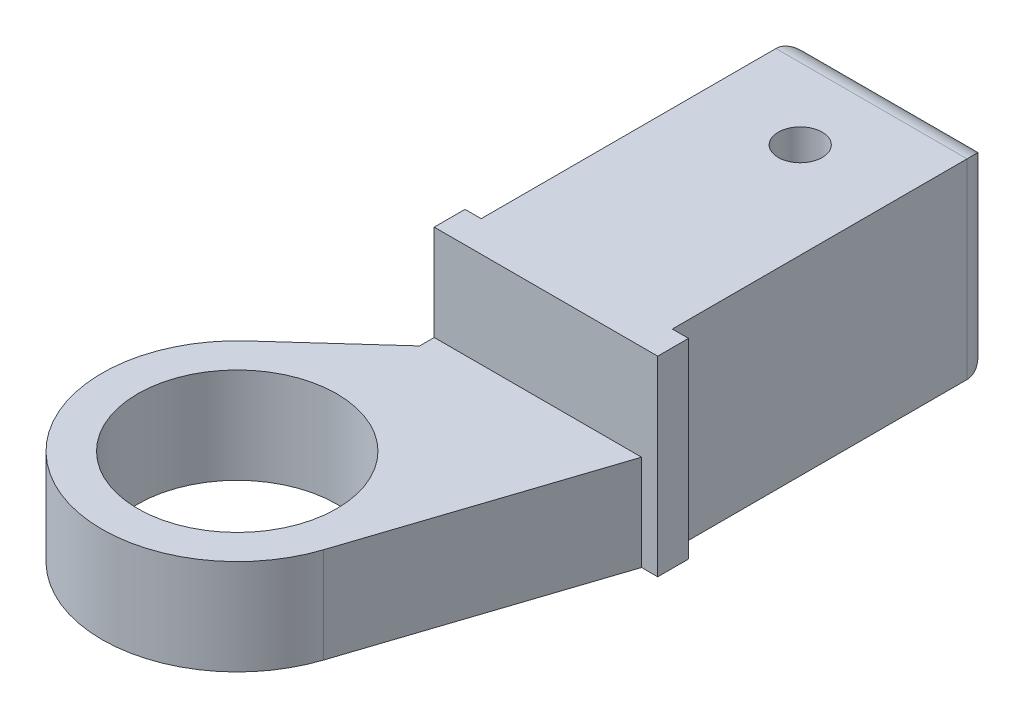
ISO-10303-21;
HEADER;
FILE_DESCRIPTION(('STEP AP214'),'2;1');
FILE_NAME('part.step','',(''),(''),'','','');
FILE_SCHEMA(('AUTOMOTIVE_DESIGN { 1 0 10303 214 1 1 1 1 }'));
ENDSEC;
DATA;
#1=APPLICATION_CONTEXT('core data for automotive mechanical design processes');
#2=APPLICATION_PROTOCOL_DEFINITION('international standard','automotive_design',2000,#1);
#3=PRODUCT_CONTEXT('',#1,'mechanical');
#4=PRODUCT('Part','Part','',(#3));
#5=PRODUCT_RELATED_PRODUCT_CATEGORY('part','',(#4));
#6=PRODUCT_DEFINITION_FORMATION('','',#4);
#7=PRODUCT_DEFINITION_CONTEXT('part definition',#1,'design');
#8=PRODUCT_DEFINITION('design','',#6,#7);
#9=PRODUCT_DEFINITION_SHAPE('','',#8);
#10=(LENGTH_UNIT() NAMED_UNIT(*) SI_UNIT(.MILLI.,.METRE.));
#11=(NAMED_UNIT(*) PLANE_ANGLE_UNIT() SI_UNIT($,.RADIAN.));
#12=(NAMED_UNIT(*) SI_UNIT($,.STERADIAN.) SOLID_ANGLE_UNIT());
#13=UNCERTAINTY_MEASURE_WITH_UNIT(LENGTH_MEASURE(1.E-05),#10,'distance_accuracy_value','');
#14=(GEOMETRIC_REPRESENTATION_CONTEXT(3) GLOBAL_UNCERTAINTY_ASSIGNED_CONTEXT((#13)) GLOBAL_UNIT_ASSIGNED_CONTEXT((#10,
#11,#12)) REPRESENTATION_CONTEXT('',''));
#15=CARTESIAN_POINT('',(0.,0.,0.));
#16=DIRECTION('',(0.,0.,1.));
#17=DIRECTION('',(1.,0.,0.));
#18=AXIS2_PLACEMENT_3D('',#15,#16,#17);
#19=CARTESIAN_POINT('',(23.8125,0.25,40.));
#20=DIRECTION('',(0.,0.,1.));
#21=DIRECTION('',(1.,0.,0.));
#22=AXIS2_PLACEMENT_3D('',#19,#20,#21);
#23=PLANE('',#22);
#24=DIRECTION('',(0.,1.,0.));
#25=VECTOR('',#24,1.);
#26=CARTESIAN_POINT('',(-1.5875,0.25,40.));
#27=LINE('',#26,#25);
#28=CARTESIAN_POINT('',(-1.5875,0.25,40.));
#29=VERTEX_POINT('',#28);
#30=CARTESIAN_POINT('',(-1.5875,21.975,40.));
#31=VERTEX_POINT('',#30);
#32=EDGE_CURVE('E189',#29,#31,#27,.T.);
#33=ORIENTED_EDGE('',*,*,#32,.F.);
#34=DIRECTION('',(1.,0.,0.));
#35=VECTOR('',#34,1.);
#36=CARTESIAN_POINT('',(-1.5875,0.25,40.));
#37=LINE('',#36,#35);
#38=CARTESIAN_POINT('',(23.8125,0.25,40.));
#39=VERTEX_POINT('',#38);
#40=EDGE_CURVE('E212',#29,#39,#37,.T.);
#41=ORIENTED_EDGE('',*,*,#40,.T.);
#42=DIRECTION('',(0.,1.,0.));
#43=VECTOR('',#42,1.);
#44=CARTESIAN_POINT('',(23.8125,0.25,40.));
#45=LINE('',#44,#43);
#46=CARTESIAN_POINT('',(23.8125,21.975,40.));
#47=VERTEX_POINT('',#46);
#48=EDGE_CURVE('E192',#39,#47,#45,.T.);
#49=ORIENTED_EDGE('',*,*,#48,.T.);
#50=DIRECTION('',(-1.,0.,0.));
#51=VECTOR('',#50,1.);
#52=CARTESIAN_POINT('',(16.54375,21.975,40.));
#53=LINE('',#52,#51);
#54=EDGE_CURVE('E190',#47,#31,#53,.T.);
#55=ORIENTED_EDGE('',*,*,#54,.T.);
#56=EDGE_LOOP('',(#33,#41,#49,#55));
#57=FACE_BOUND('',#56,.T.);
#58=ADVANCED_FACE('F48',(#57),#23,.T.);
#59=CARTESIAN_POINT('',(18.975,5.68125,3.));
#60=DIRECTION('',(0.,1.,0.));
#61=DIRECTION('',(0.707106781186548,0.,-0.707106781186547));
#62=AXIS2_PLACEMENT_3D('',#59,#60,#61);
#63=CYLINDRICAL_SURFACE('',#62,3.);
#64=DIRECTION('',(0.,-1.,0.));
#65=VECTOR('',#64,1.);
#66=CARTESIAN_POINT('',(21.975,5.68125,3.));
#67=LINE('',#66,#65);
#68=CARTESIAN_POINT('',(21.975,21.975,3.));
#69=VERTEX_POINT('',#68);
#70=CARTESIAN_POINT('',(21.975,0.25,3.));
#71=VERTEX_POINT('',#70);
#72=EDGE_CURVE('E155',#69,#71,#67,.T.);
#73=ORIENTED_EDGE('',*,*,#72,.T.);
#74=CARTESIAN_POINT('',(18.975,3.25,3.));
#75=DIRECTION('',(-0.707106781186547,-0.707106781186548,0.));
#76=DIRECTION('',(-0.707106781186548,0.707106781186547,0.));
#77=AXIS2_PLACEMENT_3D('',#74,#75,#76);
#78=ELLIPSE('',#77,4.24264068711929,3.);
#79=CARTESIAN_POINT('',(18.975,3.25,0.));
#80=VERTEX_POINT('',#79);
#81=EDGE_CURVE('E131',#80,#71,#78,.T.);
#82=ORIENTED_EDGE('',*,*,#81,.F.);
#83=DIRECTION('',(0.,1.,0.));
#84=VECTOR('',#83,1.);
#85=CARTESIAN_POINT('',(18.975,5.68125,0.));
#86=LINE('',#85,#84);
#87=CARTESIAN_POINT('',(18.975,18.975,0.));
#88=VERTEX_POINT('',#87);
#89=EDGE_CURVE('E211',#80,#88,#86,.T.);
#90=ORIENTED_EDGE('',*,*,#89,.T.);
#91=CARTESIAN_POINT('',(18.975,18.975,3.));
#92=DIRECTION('',(0.707106781186548,-0.707106781186548,0.));
#93=DIRECTION('',(-0.707106781186548,-0.707106781186548,0.));
#94=AXIS2_PLACEMENT_3D('',#91,#92,#93);
#95=ELLIPSE('',#94,4.24264068711929,3.);
#96=EDGE_CURVE('E158',#88,#69,#95,.T.);
#97=ORIENTED_EDGE('',*,*,#96,.T.);
#98=EDGE_LOOP('',(#73,#82,#90,#97));
#99=FACE_BOUND('',#98,.T.);
#100=ADVANCED_FACE('F156',(#99),#63,.T.);
#101=CARTESIAN_POINT('',(11.1125,11.1125,0.));
#102=DIRECTION('',(0.,0.,1.));
#103=DIRECTION('',(1.,0.,0.));
#104=AXIS2_PLACEMENT_3D('',#101,#102,#103);
#105=PLANE('',#104);
#106=DIRECTION('',(1.,0.,0.));
#107=VECTOR('',#106,1.);
#108=CARTESIAN_POINT('',(5.68125,3.25,0.));
#109=LINE('',#108,#107);
#110=CARTESIAN_POINT('',(3.25,3.25,0.));
#111=VERTEX_POINT('',#110);
#112=EDGE_CURVE('E138',#111,#80,#109,.T.);
#113=ORIENTED_EDGE('',*,*,#112,.F.);
#114=DIRECTION('',(0.,-1.,0.));
#115=VECTOR('',#114,1.);
#116=CARTESIAN_POINT('',(3.25,16.54375,0.));
#117=LINE('',#116,#115);
#118=CARTESIAN_POINT('',(3.25,18.975,0.));
#119=VERTEX_POINT('',#118);
#120=EDGE_CURVE('E142',#119,#111,#117,.T.);
#121=ORIENTED_EDGE('',*,*,#120,.F.);
#122=DIRECTION('',(-1.,0.,0.));
#123=VECTOR('',#122,1.);
#124=CARTESIAN_POINT('',(16.54375,18.975,0.));
#125=LINE('',#124,#123);
#126=EDGE_CURVE('E182',#88,#119,#125,.T.);
#127=ORIENTED_EDGE('',*,*,#126,.F.);
#128=ORIENTED_EDGE('',*,*,#89,.F.);
#129=EDGE_LOOP('',(#113,#121,#127,#128));
#130=FACE_BOUND('',#129,.T.);
#131=ADVANCED_FACE('F227',(#130),#105,.F.);
#132=CARTESIAN_POINT('',(3.25,16.54375,3.));
#133=DIRECTION('',(0.,-1.,0.));
#134=DIRECTION('',(-0.707106781186548,0.,-0.707106781186548));
#135=AXIS2_PLACEMENT_3D('',#132,#133,#134);
#136=CYLINDRICAL_SURFACE('',#135,3.);
#137=ORIENTED_EDGE('',*,*,#120,.T.);
#138=CARTESIAN_POINT('',(3.25,3.25,3.));
#139=DIRECTION('',(0.707106781186548,-0.707106781186547,0.));
#140=DIRECTION('',(-0.707106781186547,-0.707106781186548,0.));
#141=AXIS2_PLACEMENT_3D('',#138,#139,#140);
#142=ELLIPSE('',#141,4.24264068711929,3.);
#143=CARTESIAN_POINT('',(0.25,0.25,3.));
#144=VERTEX_POINT('',#143);
#145=EDGE_CURVE('E171',#144,#111,#142,.T.);
#146=ORIENTED_EDGE('',*,*,#145,.F.);
#147=DIRECTION('',(0.,1.,0.));
#148=VECTOR('',#147,1.);
#149=CARTESIAN_POINT('',(0.25,16.54375,3.));
#150=LINE('',#149,#148);
#151=CARTESIAN_POINT('',(0.25,21.975,3.));
#152=VERTEX_POINT('',#151);
#153=EDGE_CURVE('E180',#144,#152,#150,.T.);
#154=ORIENTED_EDGE('',*,*,#153,.T.);
#155=CARTESIAN_POINT('',(3.25,18.975,3.));
#156=DIRECTION('',(0.707106781186548,0.707106781186547,0.));
#157=DIRECTION('',(0.707106781186547,-0.707106781186548,0.));
#158=AXIS2_PLACEMENT_3D('',#155,#156,#157);
#159=ELLIPSE('',#158,4.24264068711928,3.);
#160=EDGE_CURVE('E196',#119,#152,#159,.T.);
#161=ORIENTED_EDGE('',*,*,#160,.F.);
#162=EDGE_LOOP('',(#137,#146,#154,#161));
#163=FACE_BOUND('',#162,.T.);
#164=ADVANCED_FACE('F223',(#163),#136,.T.);
#165=CARTESIAN_POINT('',(16.54375,18.975,3.));
#166=DIRECTION('',(-1.,0.,0.));
#167=DIRECTION('',(0.,0.707106781186548,-0.707106781186547));
#168=AXIS2_PLACEMENT_3D('',#165,#166,#167);
#169=CYLINDRICAL_SURFACE('',#168,3.);
#170=DIRECTION('',(1.,0.,0.));
#171=VECTOR('',#170,1.);
#172=CARTESIAN_POINT('',(16.54375,21.975,3.));
#173=LINE('',#172,#171);
#174=EDGE_CURVE('E184',#152,#69,#173,.T.);
#175=ORIENTED_EDGE('',*,*,#174,.T.);
#176=ORIENTED_EDGE('',*,*,#96,.F.);
#177=ORIENTED_EDGE('',*,*,#126,.T.);
#178=ORIENTED_EDGE('',*,*,#160,.T.);
#179=EDGE_LOOP('',(#175,#176,#177,#178));
#180=FACE_BOUND('',#179,.T.);
#181=ADVANCED_FACE('F256',(#180),#169,.T.);
#182=CARTESIAN_POINT('',(21.975,21.975,0.));
#183=DIRECTION('',(0.,1.,0.));
#184=DIRECTION('',(1.,0.,0.));
#185=AXIS2_PLACEMENT_3D('',#182,#183,#184);
#186=PLANE('',#185);
#187=CARTESIAN_POINT('',(11.1125,21.975,11.1));
#188=DIRECTION('',(0.,-1.,0.));
#189=DIRECTION('',(1.,0.,0.));
#190=AXIS2_PLACEMENT_3D('',#187,#188,#189);
#191=CIRCLE('',#190,2.5);
#192=CARTESIAN_POINT('',(8.6125,21.975,11.1));
#193=VERTEX_POINT('',#192);
#194=EDGE_CURVE('E12',#193,#193,#191,.T.);
#195=ORIENTED_EDGE('',*,*,#194,.T.);
#196=EDGE_LOOP('',(#195));
#197=FACE_BOUND('',#196,.T.);
#198=ORIENTED_EDGE('',*,*,#174,.F.);
#199=DIRECTION('',(0.,0.,1.));
#200=VECTOR('',#199,1.);
#201=CARTESIAN_POINT('',(0.25,21.975,0.));
#202=LINE('',#201,#200);
#203=CARTESIAN_POINT('',(0.25,21.975,36.5));
#204=VERTEX_POINT('',#203);
#205=EDGE_CURVE('E185',#152,#204,#202,.T.);
#206=ORIENTED_EDGE('',*,*,#205,.T.);
#207=DIRECTION('',(1.,0.,0.));
#208=VECTOR('',#207,1.);
#209=CARTESIAN_POINT('',(5.68125,21.975,36.5));
#210=LINE('',#209,#208);
#211=CARTESIAN_POINT('',(-1.5875,21.975,36.5));
#212=VERTEX_POINT('',#211);
#213=EDGE_CURVE('E178',#212,#204,#210,.T.);
#214=ORIENTED_EDGE('',*,*,#213,.F.);
#215=DIRECTION('',(0.,0.,-1.));
#216=VECTOR('',#215,1.);
#217=CARTESIAN_POINT('',(-1.5875,21.975,37.375));
#218=LINE('',#217,#216);
#219=EDGE_CURVE('E177',#31,#212,#218,.T.);
#220=ORIENTED_EDGE('',*,*,#219,.F.);
#221=ORIENTED_EDGE('',*,*,#54,.F.);
#222=DIRECTION('',(0.,0.,1.));
#223=VECTOR('',#222,1.);
#224=CARTESIAN_POINT('',(23.8125,21.975,39.125));
#225=LINE('',#224,#223);
#226=CARTESIAN_POINT('',(23.8125,21.975,36.5));
#227=VERTEX_POINT('',#226);
#228=EDGE_CURVE('E173',#227,#47,#225,.T.);
#229=ORIENTED_EDGE('',*,*,#228,.F.);
#230=DIRECTION('',(1.,0.,0.));
#231=VECTOR('',#230,1.);
#232=CARTESIAN_POINT('',(17.4625,21.975,36.5));
#233=LINE('',#232,#231);
#234=CARTESIAN_POINT('',(21.975,21.975,36.5));
#235=VERTEX_POINT('',#234);
#236=EDGE_CURVE('E193',#235,#227,#233,.T.);
#237=ORIENTED_EDGE('',*,*,#236,.F.);
#238=DIRECTION('',(0.,0.,1.));
#239=VECTOR('',#238,1.);
#240=CARTESIAN_POINT('',(21.975,21.975,0.));
#241=LINE('',#240,#239);
#242=EDGE_CURVE('E162',#69,#235,#241,.T.);
#243=ORIENTED_EDGE('',*,*,#242,.F.);
#244=EDGE_LOOP('',(#198,#206,#214,#220,#221,#229,#237,#243));
#245=FACE_BOUND('',#244,.T.);
#246=ADVANCED_FACE('F216',(#197,#245),#186,.T.);
#247=CARTESIAN_POINT('',(23.8125,0.25,40.));
#248=DIRECTION('',(1.,0.,0.));
#249=DIRECTION('',(0.,1.,0.));
#250=AXIS2_PLACEMENT_3D('',#247,#248,#249);
#251=PLANE('',#250);
#252=DIRECTION('',(0.,0.,-1.));
#253=VECTOR('',#252,1.);
#254=CARTESIAN_POINT('',(23.8125,0.25,40.));
#255=LINE('',#254,#253);
#256=CARTESIAN_POINT('',(23.8125,0.25,36.5));
#257=VERTEX_POINT('',#256);
#258=EDGE_CURVE('E213',#39,#257,#255,.T.);
#259=ORIENTED_EDGE('',*,*,#258,.T.);
#260=DIRECTION('',(0.,1.,0.));
#261=VECTOR('',#260,1.);
#262=CARTESIAN_POINT('',(23.8125,0.25,36.5));
#263=LINE('',#262,#261);
#264=EDGE_CURVE('E232',#257,#227,#263,.T.);
#265=ORIENTED_EDGE('',*,*,#264,.T.);
#266=ORIENTED_EDGE('',*,*,#228,.T.);
#267=ORIENTED_EDGE('',*,*,#48,.F.);
#268=EDGE_LOOP('',(#259,#265,#266,#267));
#269=FACE_BOUND('',#268,.T.);
#270=ADVANCED_FACE('F238',(#269),#251,.T.);
#271=CARTESIAN_POINT('',(23.8125,0.25,36.5));
#272=DIRECTION('',(0.,0.,-1.));
#273=DIRECTION('',(0.,-1.,0.));
#274=AXIS2_PLACEMENT_3D('',#271,#272,#273);
#275=PLANE('',#274);
#276=DIRECTION('',(-1.,0.,0.));
#277=VECTOR('',#276,1.);
#278=CARTESIAN_POINT('',(23.8125,0.25,36.5));
#279=LINE('',#278,#277);
#280=CARTESIAN_POINT('',(21.975,0.25,36.5));
#281=VERTEX_POINT('',#280);
#282=EDGE_CURVE('E124',#257,#281,#279,.T.);
#283=ORIENTED_EDGE('',*,*,#282,.T.);
#284=DIRECTION('',(0.,-1.,0.));
#285=VECTOR('',#284,1.);
#286=CARTESIAN_POINT('',(21.975,0.25,36.5));
#287=LINE('',#286,#285);
#288=EDGE_CURVE('E165',#235,#281,#287,.T.);
#289=ORIENTED_EDGE('',*,*,#288,.F.);
#290=ORIENTED_EDGE('',*,*,#236,.T.);
#291=ORIENTED_EDGE('',*,*,#264,.F.);
#292=EDGE_LOOP('',(#283,#289,#290,#291));
#293=FACE_BOUND('',#292,.T.);
#294=ADVANCED_FACE('F278',(#293),#275,.T.);
#295=CARTESIAN_POINT('',(21.975,0.25,0.));
#296=DIRECTION('',(1.,0.,0.));
#297=DIRECTION('',(0.,1.,0.));
#298=AXIS2_PLACEMENT_3D('',#295,#296,#297);
#299=PLANE('',#298);
#300=ORIENTED_EDGE('',*,*,#288,.T.);
#301=DIRECTION('',(0.,0.,1.));
#302=VECTOR('',#301,1.);
#303=CARTESIAN_POINT('',(21.975,0.25,0.));
#304=LINE('',#303,#302);
#305=EDGE_CURVE('E147',#71,#281,#304,.T.);
#306=ORIENTED_EDGE('',*,*,#305,.F.);
#307=ORIENTED_EDGE('',*,*,#72,.F.);
#308=ORIENTED_EDGE('',*,*,#242,.T.);
#309=EDGE_LOOP('',(#300,#306,#307,#308));
#310=FACE_BOUND('',#309,.T.);
#311=ADVANCED_FACE('F164',(#310),#299,.T.);
#312=CARTESIAN_POINT('',(5.68125,3.25,3.));
#313=DIRECTION('',(1.,0.,0.));
#314=DIRECTION('',(0.,-0.707106781186548,-0.707106781186548));
#315=AXIS2_PLACEMENT_3D('',#312,#313,#314);
#316=CYLINDRICAL_SURFACE('',#315,3.);
#317=DIRECTION('',(-1.,0.,0.));
#318=VECTOR('',#317,1.);
#319=CARTESIAN_POINT('',(5.68125,0.25,3.));
#320=LINE('',#319,#318);
#321=EDGE_CURVE('E135',#71,#144,#320,.T.);
#322=ORIENTED_EDGE('',*,*,#321,.T.);
#323=ORIENTED_EDGE('',*,*,#145,.T.);
#324=ORIENTED_EDGE('',*,*,#112,.T.);
#325=ORIENTED_EDGE('',*,*,#81,.T.);
#326=EDGE_LOOP('',(#322,#323,#324,#325));
#327=FACE_BOUND('',#326,.T.);
#328=ADVANCED_FACE('F133',(#327),#316,.T.);
#329=CARTESIAN_POINT('',(0.25,21.975,0.));
#330=DIRECTION('',(-1.,0.,0.));
#331=DIRECTION('',(0.,1.,0.));
#332=AXIS2_PLACEMENT_3D('',#329,#330,#331);
#333=PLANE('',#332);
#334=DIRECTION('',(0.,1.,0.));
#335=VECTOR('',#334,1.);
#336=CARTESIAN_POINT('',(0.25,11.1125,36.5));
#337=LINE('',#336,#335);
#338=CARTESIAN_POINT('',(0.25,0.25,36.5));
#339=VERTEX_POINT('',#338);
#340=EDGE_CURVE('E198',#339,#204,#337,.T.);
#341=ORIENTED_EDGE('',*,*,#340,.T.);
#342=ORIENTED_EDGE('',*,*,#205,.F.);
#343=ORIENTED_EDGE('',*,*,#153,.F.);
#344=DIRECTION('',(0.,0.,1.));
#345=VECTOR('',#344,1.);
#346=CARTESIAN_POINT('',(0.25,0.25,0.));
#347=LINE('',#346,#345);
#348=EDGE_CURVE('E151',#144,#339,#347,.T.);
#349=ORIENTED_EDGE('',*,*,#348,.T.);
#350=EDGE_LOOP('',(#341,#342,#343,#349));
#351=FACE_BOUND('',#350,.T.);
#352=ADVANCED_FACE('F219',(#351),#333,.T.);
#353=CARTESIAN_POINT('',(0.25,0.25,36.5));
#354=DIRECTION('',(0.,0.,-1.));
#355=DIRECTION('',(0.,-1.,0.));
#356=AXIS2_PLACEMENT_3D('',#353,#354,#355);
#357=PLANE('',#356);
#358=DIRECTION('',(-1.,0.,0.));
#359=VECTOR('',#358,1.);
#360=CARTESIAN_POINT('',(23.8125,0.25,36.5));
#361=LINE('',#360,#359);
#362=CARTESIAN_POINT('',(-1.5875,0.25,36.5));
#363=VERTEX_POINT('',#362);
#364=EDGE_CURVE('E247',#339,#363,#361,.T.);
#365=ORIENTED_EDGE('',*,*,#364,.T.);
#366=DIRECTION('',(0.,1.,0.));
#367=VECTOR('',#366,1.);
#368=CARTESIAN_POINT('',(-1.5875,0.25,36.5));
#369=LINE('',#368,#367);
#370=EDGE_CURVE('E174',#363,#212,#369,.T.);
#371=ORIENTED_EDGE('',*,*,#370,.T.);
#372=ORIENTED_EDGE('',*,*,#213,.T.);
#373=ORIENTED_EDGE('',*,*,#340,.F.);
#374=EDGE_LOOP('',(#365,#371,#372,#373));
#375=FACE_BOUND('',#374,.T.);
#376=ADVANCED_FACE('F281',(#375),#357,.T.);
#377=CARTESIAN_POINT('',(-1.5875,0.25,36.5));
#378=DIRECTION('',(-1.,0.,0.));
#379=DIRECTION('',(0.,0.,1.));
#380=AXIS2_PLACEMENT_3D('',#377,#378,#379);
#381=PLANE('',#380);
#382=DIRECTION('',(0.,0.,1.));
#383=VECTOR('',#382,1.);
#384=CARTESIAN_POINT('',(-1.5875,0.25,0.));
#385=LINE('',#384,#383);
#386=EDGE_CURVE('E52',#363,#29,#385,.T.);
#387=ORIENTED_EDGE('',*,*,#386,.T.);
#388=ORIENTED_EDGE('',*,*,#32,.T.);
#389=ORIENTED_EDGE('',*,*,#219,.T.);
#390=ORIENTED_EDGE('',*,*,#370,.F.);
#391=EDGE_LOOP('',(#387,#388,#389,#390));
#392=FACE_BOUND('',#391,.T.);
#393=ADVANCED_FACE('F245',(#392),#381,.T.);
#394=CARTESIAN_POINT('',(11.1125,21.975,11.1));
#395=DIRECTION('',(0.,-1.,0.));
#396=DIRECTION('',(1.,0.,0.));
#397=AXIS2_PLACEMENT_3D('',#394,#395,#396);
#398=CYLINDRICAL_SURFACE('',#397,2.5);
#399=ORIENTED_EDGE('',*,*,#194,.F.);
#400=DIRECTION('',(0.,-1.,0.));
#401=VECTOR('',#400,1.);
#402=CARTESIAN_POINT('',(8.6125,21.975,11.1));
#403=LINE('',#402,#401);
#404=CARTESIAN_POINT('',(8.6125,0.249999999999995,11.1));
#405=VERTEX_POINT('',#404);
#406=EDGE_CURVE('E58',#193,#405,#403,.T.);
#407=ORIENTED_EDGE('',*,*,#406,.T.);
#408=CARTESIAN_POINT('',(11.1125,0.249999999999995,11.1));
#409=DIRECTION('',(0.,1.,0.));
#410=DIRECTION('',(1.,0.,0.));
#411=AXIS2_PLACEMENT_3D('',#408,#409,#410);
#412=CIRCLE('',#411,2.5);
#413=EDGE_CURVE('E167',#405,#405,#412,.T.);
#414=ORIENTED_EDGE('',*,*,#413,.F.);
#415=ORIENTED_EDGE('',*,*,#406,.F.);
#416=EDGE_LOOP('',(#399,#407,#414,#415));
#417=FACE_BOUND('',#416,.T.);
#418=ADVANCED_FACE('F280',(#417),#398,.F.);
#419=CARTESIAN_POINT('',(0.25,0.25,0.));
#420=DIRECTION('',(0.,-1.,0.));
#421=DIRECTION('',(0.,0.,-1.));
#422=AXIS2_PLACEMENT_3D('',#419,#420,#421);
#423=PLANE('',#422);
#424=ORIENTED_EDGE('',*,*,#413,.T.);
#425=EDGE_LOOP('',(#424));
#426=FACE_BOUND('',#425,.T.);
#427=ORIENTED_EDGE('',*,*,#40,.F.);
#428=ORIENTED_EDGE('',*,*,#386,.F.);
#429=ORIENTED_EDGE('',*,*,#364,.F.);
#430=ORIENTED_EDGE('',*,*,#348,.F.);
#431=ORIENTED_EDGE('',*,*,#321,.F.);
#432=ORIENTED_EDGE('',*,*,#305,.T.);
#433=ORIENTED_EDGE('',*,*,#282,.F.);
#434=ORIENTED_EDGE('',*,*,#258,.F.);
#435=EDGE_LOOP('',(#427,#428,#429,#430,#431,#432,#433,#434));
#436=FACE_BOUND('',#435,.T.);
#437=ADVANCED_FACE('F50',(#426,#436),#423,.T.);
#438=CLOSED_SHELL('',(#58,#100,#131,#164,#181,#246,#270,#294,#311,#328,#352,#376,#393,#418,#437));
#439=MANIFOLD_SOLID_BREP('B2',#438);
#440=CARTESIAN_POINT('',(23.8125,0.25,40.));
#441=DIRECTION('',(0.,0.,1.));
#442=DIRECTION('',(1.,0.,0.));
#443=AXIS2_PLACEMENT_3D('',#440,#441,#442);
#444=PLANE('',#443);
#445=DIRECTION('',(0.,1.,0.));
#446=VECTOR('',#445,1.);
#447=CARTESIAN_POINT('',(21.975,0.25,40.));
#448=LINE('',#447,#446);
#449=CARTESIAN_POINT('',(21.975,0.25,40.));
#450=VERTEX_POINT('',#449);
#451=CARTESIAN_POINT('',(21.975,11.1125,40.));
#452=VERTEX_POINT('',#451);
#453=EDGE_CURVE('E478',#450,#452,#448,.T.);
#454=ORIENTED_EDGE('',*,*,#453,.F.);
#455=DIRECTION('',(-1.,0.,0.));
#456=VECTOR('',#455,1.);
#457=CARTESIAN_POINT('',(0.25,0.25,40.));
#458=LINE('',#457,#456);
#459=CARTESIAN_POINT('',(-1.5875,0.25,40.));
#460=VERTEX_POINT('',#459);
#461=EDGE_CURVE('E46',#450,#460,#458,.T.);
#462=ORIENTED_EDGE('',*,*,#461,.T.);
#463=DIRECTION('',(0.,1.,0.));
#464=VECTOR('',#463,1.);
#465=CARTESIAN_POINT('',(-1.5875,0.25,40.));
#466=LINE('',#465,#464);
#467=CARTESIAN_POINT('',(-1.5875,11.1125,40.));
#468=VERTEX_POINT('',#467);
#469=EDGE_CURVE('E389',#460,#468,#466,.T.);
#470=ORIENTED_EDGE('',*,*,#469,.T.);
#471=DIRECTION('',(-1.,0.,0.));
#472=VECTOR('',#471,1.);
#473=CARTESIAN_POINT('',(0.460520564077921,11.1125,40.));
#474=LINE('',#473,#472);
#475=EDGE_CURVE('E473',#452,#468,#474,.T.);
#476=ORIENTED_EDGE('',*,*,#475,.F.);
#477=EDGE_LOOP('',(#454,#462,#470,#476));
#478=FACE_BOUND('',#477,.T.);
#479=ADVANCED_FACE('F386',(#478),#444,.F.);
#480=CARTESIAN_POINT('',(-1.5875,0.25,62.3880365220042));
#481=DIRECTION('',(0.,1.,0.));
#482=DIRECTION('',(1.,0.,0.));
#483=AXIS2_PLACEMENT_3D('',#480,#481,#482);
#484=CYLINDRICAL_SURFACE('',#483,11.3125);
#485=CARTESIAN_POINT('',(-1.5875,11.1125,62.3880365220042));
#486=DIRECTION('',(0.,-1.,0.));
#487=DIRECTION('',(1.,0.,0.));
#488=AXIS2_PLACEMENT_3D('',#485,#486,#487);
#489=CIRCLE('',#488,11.3125);
#490=CARTESIAN_POINT('',(-12.9,11.1125,62.3880365220042));
#491=VERTEX_POINT('',#490);
#492=EDGE_CURVE('E450',#491,#491,#489,.T.);
#493=ORIENTED_EDGE('',*,*,#492,.F.);
#494=DIRECTION('',(0.,-1.,0.));
#495=VECTOR('',#494,1.);
#496=CARTESIAN_POINT('',(-12.9,0.25,62.3880365220042));
#497=LINE('',#496,#495);
#498=CARTESIAN_POINT('',(-12.9,0.25,62.3880365220042));
#499=VERTEX_POINT('',#498);
#500=EDGE_CURVE('E407',#491,#499,#497,.T.);
#501=ORIENTED_EDGE('',*,*,#500,.T.);
#502=CARTESIAN_POINT('',(-1.5875,0.25,62.3880365220042));
#503=DIRECTION('',(0.,1.,0.));
#504=DIRECTION('',(1.,0.,0.));
#505=AXIS2_PLACEMENT_3D('',#502,#503,#504);
#506=CIRCLE('',#505,11.3125);
#507=EDGE_CURVE('E439',#499,#499,#506,.T.);
#508=ORIENTED_EDGE('',*,*,#507,.F.);
#509=ORIENTED_EDGE('',*,*,#500,.F.);
#510=EDGE_LOOP('',(#493,#501,#508,#509));
#511=FACE_BOUND('',#510,.T.);
#512=ADVANCED_FACE('F498',(#511),#484,.F.);
#513=CARTESIAN_POINT('',(-1.5875,0.25,36.5));
#514=DIRECTION('',(-1.,0.,0.));
#515=DIRECTION('',(0.,0.,1.));
#516=AXIS2_PLACEMENT_3D('',#513,#514,#515);
#517=PLANE('',#516);
#518=ORIENTED_EDGE('',*,*,#469,.F.);
#519=DIRECTION('',(0.,0.,1.));
#520=VECTOR('',#519,1.);
#521=CARTESIAN_POINT('',(-1.5875,0.25,0.));
#522=LINE('',#521,#520);
#523=CARTESIAN_POINT('',(-1.5875,0.25,41.6621551259154));
#524=VERTEX_POINT('',#523);
#525=EDGE_CURVE('E432',#460,#524,#522,.T.);
#526=ORIENTED_EDGE('',*,*,#525,.T.);
#527=DIRECTION('',(0.,1.,0.));
#528=VECTOR('',#527,1.);
#529=CARTESIAN_POINT('',(-1.5875,0.25,41.6621551259154));
#530=LINE('',#529,#528);
#531=CARTESIAN_POINT('',(-1.5875,11.1125,41.6621551259154));
#532=VERTEX_POINT('',#531);
#533=EDGE_CURVE('E435',#524,#532,#530,.T.);
#534=ORIENTED_EDGE('',*,*,#533,.T.);
#535=DIRECTION('',(0.,0.,1.));
#536=VECTOR('',#535,1.);
#537=CARTESIAN_POINT('',(-1.5875,11.1125,0.));
#538=LINE('',#537,#536);
#539=EDGE_CURVE('E461',#468,#532,#538,.T.);
#540=ORIENTED_EDGE('',*,*,#539,.F.);
#541=EDGE_LOOP('',(#518,#526,#534,#540));
#542=FACE_BOUND('',#541,.T.);
#543=ADVANCED_FACE('F434',(#542),#517,.T.);
#544=CARTESIAN_POINT('',(-1.5875,0.25,41.6621551259154));
#545=DIRECTION('',(-0.670836783631383,0.,-0.741605022722406));
#546=DIRECTION('',(-0.741605022722406,0.,0.670836783631383));
#547=AXIS2_PLACEMENT_3D('',#544,#545,#546);
#548=PLANE('',#547);
#549=DIRECTION('',(-0.741605022722406,0.,0.670836783631383));
#550=VECTOR('',#549,1.);
#551=CARTESIAN_POINT('',(0.25,0.25,40.));
#552=LINE('',#551,#550);
#553=CARTESIAN_POINT('',(-11.8985416022466,0.25,50.9892575219433));
#554=VERTEX_POINT('',#553);
#555=EDGE_CURVE('E440',#524,#554,#552,.T.);
#556=ORIENTED_EDGE('',*,*,#555,.T.);
#557=DIRECTION('',(0.,1.,0.));
#558=VECTOR('',#557,1.);
#559=CARTESIAN_POINT('',(-11.8985416022466,0.25,50.9892575219433));
#560=LINE('',#559,#558);
#561=CARTESIAN_POINT('',(-11.8985416022466,11.1125,50.9892575219433));
#562=VERTEX_POINT('',#561);
#563=EDGE_CURVE('E464',#554,#562,#560,.T.);
#564=ORIENTED_EDGE('',*,*,#563,.T.);
#565=DIRECTION('',(-0.741605022722406,0.,0.670836783631383));
#566=VECTOR('',#565,1.);
#567=CARTESIAN_POINT('',(0.25,11.1125,40.));
#568=LINE('',#567,#566);
#569=EDGE_CURVE('E448',#532,#562,#568,.T.);
#570=ORIENTED_EDGE('',*,*,#569,.F.);
#571=ORIENTED_EDGE('',*,*,#533,.F.);
#572=EDGE_LOOP('',(#556,#564,#570,#571));
#573=FACE_BOUND('',#572,.T.);
#574=ADVANCED_FACE('F444',(#573),#548,.T.);
#575=CARTESIAN_POINT('',(-1.5875,0.25,62.3880365220042));
#576=DIRECTION('',(0.,1.,0.));
#577=DIRECTION('',(-0.545442437282533,0.,0.838148284977837));
#578=AXIS2_PLACEMENT_3D('',#575,#576,#577);
#579=CYLINDRICAL_SURFACE('',#578,15.3704177436883);
#580=CARTESIAN_POINT('',(-1.5875,0.25,62.3880365220042));
#581=DIRECTION('',(0.,-1.,0.));
#582=DIRECTION('',(1.,0.,0.));
#583=AXIS2_PLACEMENT_3D('',#580,#581,#582);
#584=CIRCLE('',#583,15.3704177436883);
#585=CARTESIAN_POINT('',(13.0104872451171,0.25,67.1993263705675));
#586=VERTEX_POINT('',#585);
#587=EDGE_CURVE('E456',#586,#554,#584,.T.);
#588=ORIENTED_EDGE('',*,*,#587,.F.);
#589=DIRECTION('',(0.,1.,0.));
#590=VECTOR('',#589,1.);
#591=CARTESIAN_POINT('',(13.0104872451171,0.25,67.1993263705675));
#592=LINE('',#591,#590);
#593=CARTESIAN_POINT('',(13.0104872451171,11.1125,67.1993263705675));
#594=VERTEX_POINT('',#593);
#595=EDGE_CURVE('E466',#586,#594,#592,.T.);
#596=ORIENTED_EDGE('',*,*,#595,.T.);
#597=CARTESIAN_POINT('',(-1.5875,11.1125,62.3880365220042));
#598=DIRECTION('',(0.,1.,0.));
#599=DIRECTION('',(1.,0.,0.));
#600=AXIS2_PLACEMENT_3D('',#597,#598,#599);
#601=CIRCLE('',#600,15.3704177436883);
#602=EDGE_CURVE('E468',#562,#594,#601,.T.);
#603=ORIENTED_EDGE('',*,*,#602,.F.);
#604=ORIENTED_EDGE('',*,*,#563,.F.);
#605=EDGE_LOOP('',(#588,#596,#603,#604));
#606=FACE_BOUND('',#605,.T.);
#607=ADVANCED_FACE('F487',(#606),#579,.T.);
#608=CARTESIAN_POINT('',(13.0104872451171,0.25,67.1993263705675));
#609=DIRECTION('',(0.949745640525064,0.,0.313022712121079));
#610=DIRECTION('',(0.,-1.,0.));
#611=AXIS2_PLACEMENT_3D('',#608,#609,#610);
#612=PLANE('',#611);
#613=DIRECTION('',(-0.313022712121079,0.,0.949745640525064));
#614=VECTOR('',#613,1.);
#615=CARTESIAN_POINT('',(21.975,0.25,40.));
#616=LINE('',#615,#614);
#617=EDGE_CURVE('E458',#450,#586,#616,.T.);
#618=ORIENTED_EDGE('',*,*,#617,.F.);
#619=ORIENTED_EDGE('',*,*,#453,.T.);
#620=DIRECTION('',(0.313022712121079,0.,-0.949745640525064));
#621=VECTOR('',#620,1.);
#622=CARTESIAN_POINT('',(21.975,11.1125,40.));
#623=LINE('',#622,#621);
#624=EDGE_CURVE('E469',#594,#452,#623,.T.);
#625=ORIENTED_EDGE('',*,*,#624,.F.);
#626=ORIENTED_EDGE('',*,*,#595,.F.);
#627=EDGE_LOOP('',(#618,#619,#625,#626));
#628=FACE_BOUND('',#627,.T.);
#629=ADVANCED_FACE('F490',(#628),#612,.T.);
#630=CARTESIAN_POINT('',(0.25,0.25,0.));
#631=DIRECTION('',(0.,-1.,0.));
#632=DIRECTION('',(0.,0.,-1.));
#633=AXIS2_PLACEMENT_3D('',#630,#631,#632);
#634=PLANE('',#633);
#635=ORIENTED_EDGE('',*,*,#461,.F.);
#636=ORIENTED_EDGE('',*,*,#617,.T.);
#637=ORIENTED_EDGE('',*,*,#587,.T.);
#638=ORIENTED_EDGE('',*,*,#555,.F.);
#639=ORIENTED_EDGE('',*,*,#525,.F.);
#640=EDGE_LOOP('',(#635,#636,#637,#638,#639));
#641=FACE_BOUND('',#640,.T.);
#642=ORIENTED_EDGE('',*,*,#507,.T.);
#643=EDGE_LOOP('',(#642));
#644=FACE_BOUND('',#643,.T.);
#645=ADVANCED_FACE('F452',(#641,#644),#634,.T.);
#646=CARTESIAN_POINT('',(2.50854112815585,11.1125,57.1292271328463));
#647=DIRECTION('',(0.,-1.,0.));
#648=DIRECTION('',(0.,0.,-1.));
#649=AXIS2_PLACEMENT_3D('',#646,#647,#648);
#650=PLANE('',#649);
#651=ORIENTED_EDGE('',*,*,#492,.T.);
#652=EDGE_LOOP('',(#651));
#653=FACE_BOUND('',#652,.T.);
#654=ORIENTED_EDGE('',*,*,#475,.T.);
#655=ORIENTED_EDGE('',*,*,#539,.T.);
#656=ORIENTED_EDGE('',*,*,#569,.T.);
#657=ORIENTED_EDGE('',*,*,#602,.T.);
#658=ORIENTED_EDGE('',*,*,#624,.T.);
#659=EDGE_LOOP('',(#654,#655,#656,#657,#658));
#660=FACE_BOUND('',#659,.T.);
#661=ADVANCED_FACE('F493',(#653,#660),#650,.F.);
#662=CLOSED_SHELL('',(#479,#512,#543,#574,#607,#629,#645,#661));
#663=MANIFOLD_SOLID_BREP('B6',#662);
#664=ADVANCED_BREP_SHAPE_REPRESENTATION('',(#18,#439,#663),#14);
#665=SHAPE_DEFINITION_REPRESENTATION(#9,#664);
ENDSEC;
END-ISO-10303-21;
